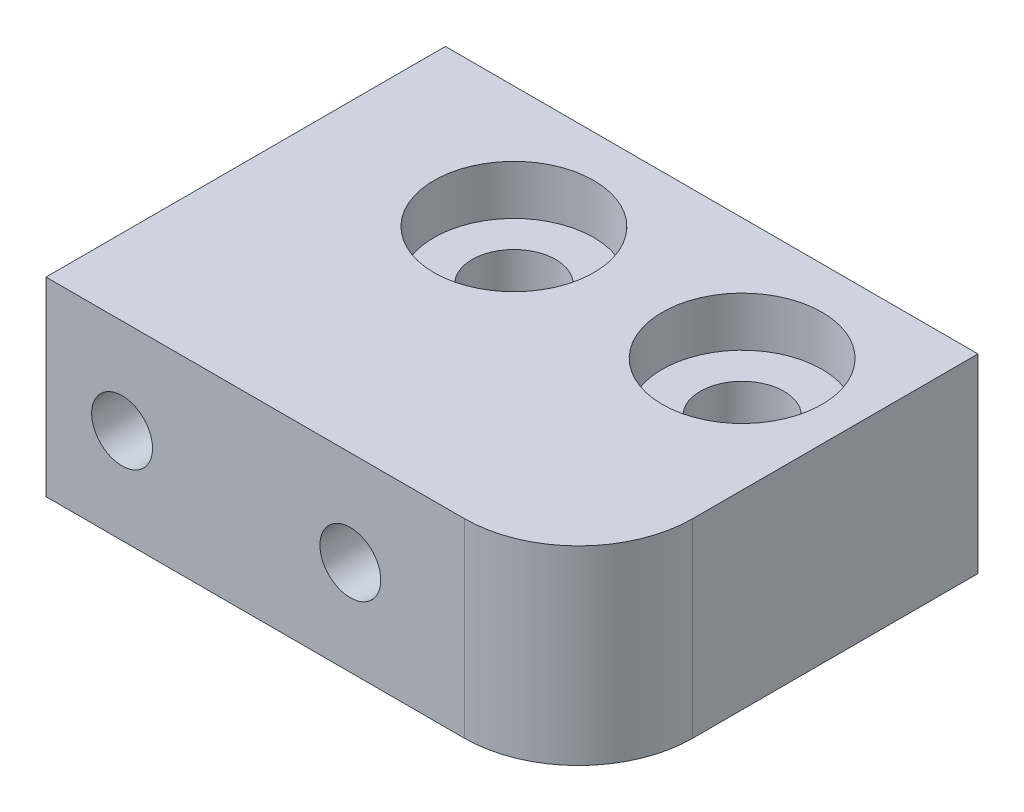
ISO-10303-21;
HEADER;
FILE_DESCRIPTION(('STEP AP214'),'2;1');
FILE_NAME('part.step','',(''),(''),'','','');
FILE_SCHEMA(('AUTOMOTIVE_DESIGN { 1 0 10303 214 1 1 1 1 }'));
ENDSEC;
DATA;
#1=APPLICATION_CONTEXT('core data for automotive mechanical design processes');
#2=APPLICATION_PROTOCOL_DEFINITION('international standard','automotive_design',2000,#1);
#3=PRODUCT_CONTEXT('',#1,'mechanical');
#4=PRODUCT('Part','Part','',(#3));
#5=PRODUCT_RELATED_PRODUCT_CATEGORY('part','',(#4));
#6=PRODUCT_DEFINITION_FORMATION('','',#4);
#7=PRODUCT_DEFINITION_CONTEXT('part definition',#1,'design');
#8=PRODUCT_DEFINITION('design','',#6,#7);
#9=PRODUCT_DEFINITION_SHAPE('','',#8);
#10=(LENGTH_UNIT() NAMED_UNIT(*) SI_UNIT(.MILLI.,.METRE.));
#11=(NAMED_UNIT(*) PLANE_ANGLE_UNIT() SI_UNIT($,.RADIAN.));
#12=(NAMED_UNIT(*) SI_UNIT($,.STERADIAN.) SOLID_ANGLE_UNIT());
#13=UNCERTAINTY_MEASURE_WITH_UNIT(LENGTH_MEASURE(1.E-05),#10,'distance_accuracy_value','');
#14=(GEOMETRIC_REPRESENTATION_CONTEXT(3) GLOBAL_UNCERTAINTY_ASSIGNED_CONTEXT((#13)) GLOBAL_UNIT_ASSIGNED_CONTEXT((#10,
#11,#12)) REPRESENTATION_CONTEXT('',''));
#15=CARTESIAN_POINT('',(0.,0.,0.));
#16=DIRECTION('',(0.,0.,1.));
#17=DIRECTION('',(1.,0.,0.));
#18=AXIS2_PLACEMENT_3D('',#15,#16,#17);
#19=CARTESIAN_POINT('',(7.,5.,-5.25));
#20=DIRECTION('',(-1.,0.,0.));
#21=DIRECTION('',(0.,0.,1.));
#22=AXIS2_PLACEMENT_3D('',#19,#20,#21);
#23=PLANE('',#22);
#24=DIRECTION('',(0.,0.,-1.));
#25=VECTOR('',#24,1.);
#26=CARTESIAN_POINT('',(7.,5.,-5.25));
#27=LINE('',#26,#25);
#28=CARTESIAN_POINT('',(7.,5.,2.25));
#29=VERTEX_POINT('',#28);
#30=CARTESIAN_POINT('',(7.,5.,-5.25));
#31=VERTEX_POINT('',#30);
#32=EDGE_CURVE('E82',#29,#31,#27,.T.);
#33=ORIENTED_EDGE('',*,*,#32,.F.);
#34=DIRECTION('',(0.,-1.,0.));
#35=VECTOR('',#34,1.);
#36=CARTESIAN_POINT('',(7.,5.,2.25));
#37=LINE('',#36,#35);
#38=CARTESIAN_POINT('',(7.,0.,2.25));
#39=VERTEX_POINT('',#38);
#40=EDGE_CURVE('E105',#29,#39,#37,.T.);
#41=ORIENTED_EDGE('',*,*,#40,.T.);
#42=DIRECTION('',(0.,0.,-1.));
#43=VECTOR('',#42,1.);
#44=CARTESIAN_POINT('',(7.,0.,-5.25));
#45=LINE('',#44,#43);
#46=CARTESIAN_POINT('',(7.,0.,-5.25));
#47=VERTEX_POINT('',#46);
#48=EDGE_CURVE('E103',#39,#47,#45,.T.);
#49=ORIENTED_EDGE('',*,*,#48,.T.);
#50=DIRECTION('',(0.,-1.,0.));
#51=VECTOR('',#50,1.);
#52=CARTESIAN_POINT('',(7.,5.,-5.25));
#53=LINE('',#52,#51);
#54=EDGE_CURVE('E97',#31,#47,#53,.T.);
#55=ORIENTED_EDGE('',*,*,#54,.F.);
#56=EDGE_LOOP('',(#33,#41,#49,#55));
#57=FACE_BOUND('',#56,.T.);
#58=ADVANCED_FACE('F36',(#57),#23,.F.);
#59=CARTESIAN_POINT('',(-7.,5.,-5.25));
#60=DIRECTION('',(0.,0.,1.));
#61=DIRECTION('',(1.,0.,0.));
#62=AXIS2_PLACEMENT_3D('',#59,#60,#61);
#63=PLANE('',#62);
#64=CARTESIAN_POINT('',(-5.,2.5,-5.25));
#65=DIRECTION('',(0.,0.,1.));
#66=DIRECTION('',(1.,0.,0.));
#67=AXIS2_PLACEMENT_3D('',#64,#65,#66);
#68=CIRCLE('',#67,0.799999999999997);
#69=CARTESIAN_POINT('',(-4.2,2.5,-5.25));
#70=VERTEX_POINT('',#69);
#71=EDGE_CURVE('E153',#70,#70,#68,.T.);
#72=ORIENTED_EDGE('',*,*,#71,.T.);
#73=EDGE_LOOP('',(#72));
#74=FACE_BOUND('',#73,.T.);
#75=CARTESIAN_POINT('',(1.,2.5,-5.25));
#76=DIRECTION('',(0.,0.,1.));
#77=DIRECTION('',(1.,0.,0.));
#78=AXIS2_PLACEMENT_3D('',#75,#76,#77);
#79=CIRCLE('',#78,0.799999999999997);
#80=CARTESIAN_POINT('',(1.8,2.5,-5.25));
#81=VERTEX_POINT('',#80);
#82=EDGE_CURVE('E147',#81,#81,#79,.T.);
#83=ORIENTED_EDGE('',*,*,#82,.T.);
#84=EDGE_LOOP('',(#83));
#85=FACE_BOUND('',#84,.T.);
#86=DIRECTION('',(-1.,0.,0.));
#87=VECTOR('',#86,1.);
#88=CARTESIAN_POINT('',(-7.,0.,-5.25));
#89=LINE('',#88,#87);
#90=CARTESIAN_POINT('',(-7.,0.,-5.25));
#91=VERTEX_POINT('',#90);
#92=EDGE_CURVE('E118',#47,#91,#89,.T.);
#93=ORIENTED_EDGE('',*,*,#92,.T.);
#94=DIRECTION('',(0.,-1.,0.));
#95=VECTOR('',#94,1.);
#96=CARTESIAN_POINT('',(-7.,5.,-5.25));
#97=LINE('',#96,#95);
#98=CARTESIAN_POINT('',(-7.,5.,-5.25));
#99=VERTEX_POINT('',#98);
#100=EDGE_CURVE('E99',#99,#91,#97,.T.);
#101=ORIENTED_EDGE('',*,*,#100,.F.);
#102=DIRECTION('',(-1.,0.,0.));
#103=VECTOR('',#102,1.);
#104=CARTESIAN_POINT('',(-7.,5.,-5.25));
#105=LINE('',#104,#103);
#106=EDGE_CURVE('E85',#31,#99,#105,.T.);
#107=ORIENTED_EDGE('',*,*,#106,.F.);
#108=ORIENTED_EDGE('',*,*,#54,.T.);
#109=EDGE_LOOP('',(#93,#101,#107,#108));
#110=FACE_BOUND('',#109,.T.);
#111=ADVANCED_FACE('F96',(#74,#85,#110),#63,.F.);
#112=CARTESIAN_POINT('',(-7.,5.,-5.25));
#113=DIRECTION('',(1.,0.,0.));
#114=DIRECTION('',(0.,0.,-1.));
#115=AXIS2_PLACEMENT_3D('',#112,#113,#114);
#116=PLANE('',#115);
#117=DIRECTION('',(0.,0.,1.));
#118=VECTOR('',#117,1.);
#119=CARTESIAN_POINT('',(-7.,0.,-5.25));
#120=LINE('',#119,#118);
#121=CARTESIAN_POINT('',(-7.,0.,5.25));
#122=VERTEX_POINT('',#121);
#123=EDGE_CURVE('E116',#91,#122,#120,.T.);
#124=ORIENTED_EDGE('',*,*,#123,.T.);
#125=DIRECTION('',(0.,-1.,0.));
#126=VECTOR('',#125,1.);
#127=CARTESIAN_POINT('',(-7.,5.,5.25));
#128=LINE('',#127,#126);
#129=CARTESIAN_POINT('',(-7.,5.,5.25));
#130=VERTEX_POINT('',#129);
#131=EDGE_CURVE('E108',#130,#122,#128,.T.);
#132=ORIENTED_EDGE('',*,*,#131,.F.);
#133=DIRECTION('',(0.,0.,1.));
#134=VECTOR('',#133,1.);
#135=CARTESIAN_POINT('',(-7.,5.,-5.25));
#136=LINE('',#135,#134);
#137=EDGE_CURVE('E101',#99,#130,#136,.T.);
#138=ORIENTED_EDGE('',*,*,#137,.F.);
#139=ORIENTED_EDGE('',*,*,#100,.T.);
#140=EDGE_LOOP('',(#124,#132,#138,#139));
#141=FACE_BOUND('',#140,.T.);
#142=ADVANCED_FACE('F165',(#141),#116,.F.);
#143=CARTESIAN_POINT('',(-7.,5.,5.25));
#144=DIRECTION('',(0.,0.,-1.));
#145=DIRECTION('',(-1.,0.,0.));
#146=AXIS2_PLACEMENT_3D('',#143,#144,#145);
#147=PLANE('',#146);
#148=CARTESIAN_POINT('',(-5.,2.5,5.25));
#149=DIRECTION('',(0.,0.,1.));
#150=DIRECTION('',(1.,0.,0.));
#151=AXIS2_PLACEMENT_3D('',#148,#149,#150);
#152=CIRCLE('',#151,0.799999999999988);
#153=CARTESIAN_POINT('',(-4.20000000000001,2.5,5.25));
#154=VERTEX_POINT('',#153);
#155=EDGE_CURVE('E156',#154,#154,#152,.T.);
#156=ORIENTED_EDGE('',*,*,#155,.F.);
#157=EDGE_LOOP('',(#156));
#158=FACE_BOUND('',#157,.T.);
#159=CARTESIAN_POINT('',(1.,2.5,5.25));
#160=DIRECTION('',(0.,0.,1.));
#161=DIRECTION('',(1.,0.,0.));
#162=AXIS2_PLACEMENT_3D('',#159,#160,#161);
#163=CIRCLE('',#162,0.799999999999988);
#164=CARTESIAN_POINT('',(1.79999999999999,2.5,5.25));
#165=VERTEX_POINT('',#164);
#166=EDGE_CURVE('E150',#165,#165,#163,.T.);
#167=ORIENTED_EDGE('',*,*,#166,.F.);
#168=EDGE_LOOP('',(#167));
#169=FACE_BOUND('',#168,.T.);
#170=DIRECTION('',(1.,0.,0.));
#171=VECTOR('',#170,1.);
#172=CARTESIAN_POINT('',(-7.,0.,5.25));
#173=LINE('',#172,#171);
#174=CARTESIAN_POINT('',(4.,0.,5.25));
#175=VERTEX_POINT('',#174);
#176=EDGE_CURVE('E92',#122,#175,#173,.T.);
#177=ORIENTED_EDGE('',*,*,#176,.T.);
#178=DIRECTION('',(0.,-1.,0.));
#179=VECTOR('',#178,1.);
#180=CARTESIAN_POINT('',(4.,5.,5.25));
#181=LINE('',#180,#179);
#182=CARTESIAN_POINT('',(4.,5.,5.25));
#183=VERTEX_POINT('',#182);
#184=EDGE_CURVE('E44',#175,#183,#181,.F.);
#185=ORIENTED_EDGE('',*,*,#184,.T.);
#186=DIRECTION('',(1.,0.,0.));
#187=VECTOR('',#186,1.);
#188=CARTESIAN_POINT('',(-7.,5.,5.25));
#189=LINE('',#188,#187);
#190=EDGE_CURVE('E114',#130,#183,#189,.T.);
#191=ORIENTED_EDGE('',*,*,#190,.F.);
#192=ORIENTED_EDGE('',*,*,#131,.T.);
#193=EDGE_LOOP('',(#177,#185,#191,#192));
#194=FACE_BOUND('',#193,.T.);
#195=ADVANCED_FACE('F162',(#158,#169,#194),#147,.F.);
#196=CARTESIAN_POINT('',(0.,5.,0.));
#197=DIRECTION('',(0.,1.,0.));
#198=DIRECTION('',(0.,0.,1.));
#199=AXIS2_PLACEMENT_3D('',#196,#197,#198);
#200=PLANE('',#199);
#201=CARTESIAN_POINT('',(-2.,5.,-2.05));
#202=DIRECTION('',(0.,1.,0.));
#203=DIRECTION('',(0.,0.,1.));
#204=AXIS2_PLACEMENT_3D('',#201,#202,#203);
#205=CIRCLE('',#204,2.10000000000002);
#206=CARTESIAN_POINT('',(-2.,5.,0.0500000000000157));
#207=VERTEX_POINT('',#206);
#208=EDGE_CURVE('E144',#207,#207,#205,.T.);
#209=ORIENTED_EDGE('',*,*,#208,.F.);
#210=EDGE_LOOP('',(#209));
#211=FACE_BOUND('',#210,.T.);
#212=CARTESIAN_POINT('',(4.,5.,-2.05));
#213=DIRECTION('',(0.,1.,0.));
#214=DIRECTION('',(0.,0.,1.));
#215=AXIS2_PLACEMENT_3D('',#212,#213,#214);
#216=CIRCLE('',#215,2.10000000000002);
#217=CARTESIAN_POINT('',(4.,5.,0.0500000000000157));
#218=VERTEX_POINT('',#217);
#219=EDGE_CURVE('E132',#218,#218,#216,.T.);
#220=ORIENTED_EDGE('',*,*,#219,.F.);
#221=EDGE_LOOP('',(#220));
#222=FACE_BOUND('',#221,.T.);
#223=ORIENTED_EDGE('',*,*,#190,.T.);
#224=CARTESIAN_POINT('',(4.,5.,2.25));
#225=DIRECTION('',(0.,1.,0.));
#226=DIRECTION('',(0.,0.,1.));
#227=AXIS2_PLACEMENT_3D('',#224,#225,#226);
#228=CIRCLE('',#227,3.);
#229=EDGE_CURVE('E11',#183,#29,#228,.T.);
#230=ORIENTED_EDGE('',*,*,#229,.T.);
#231=ORIENTED_EDGE('',*,*,#32,.T.);
#232=ORIENTED_EDGE('',*,*,#106,.T.);
#233=ORIENTED_EDGE('',*,*,#137,.T.);
#234=EDGE_LOOP('',(#223,#230,#231,#232,#233));
#235=FACE_BOUND('',#234,.T.);
#236=ADVANCED_FACE('F84',(#211,#222,#235),#200,.T.);
#237=CARTESIAN_POINT('',(0.,0.,0.));
#238=DIRECTION('',(0.,1.,0.));
#239=DIRECTION('',(0.,0.,1.));
#240=AXIS2_PLACEMENT_3D('',#237,#238,#239);
#241=PLANE('',#240);
#242=CARTESIAN_POINT('',(-2.,0.,-2.05));
#243=DIRECTION('',(0.,1.,0.));
#244=DIRECTION('',(0.,0.,1.));
#245=AXIS2_PLACEMENT_3D('',#242,#243,#244);
#246=CIRCLE('',#245,1.10000000000001);
#247=CARTESIAN_POINT('',(-2.,0.,-0.949999999999986));
#248=VERTEX_POINT('',#247);
#249=EDGE_CURVE('E135',#248,#248,#246,.T.);
#250=ORIENTED_EDGE('',*,*,#249,.T.);
#251=EDGE_LOOP('',(#250));
#252=FACE_BOUND('',#251,.T.);
#253=CARTESIAN_POINT('',(4.,0.,-2.05));
#254=DIRECTION('',(0.,1.,0.));
#255=DIRECTION('',(0.,0.,1.));
#256=AXIS2_PLACEMENT_3D('',#253,#254,#255);
#257=CIRCLE('',#256,1.10000000000001);
#258=CARTESIAN_POINT('',(4.,0.,-0.949999999999987));
#259=VERTEX_POINT('',#258);
#260=EDGE_CURVE('E121',#259,#259,#257,.T.);
#261=ORIENTED_EDGE('',*,*,#260,.T.);
#262=EDGE_LOOP('',(#261));
#263=FACE_BOUND('',#262,.T.);
#264=ORIENTED_EDGE('',*,*,#48,.F.);
#265=CARTESIAN_POINT('',(4.,0.,2.25));
#266=DIRECTION('',(0.,1.,0.));
#267=DIRECTION('',(0.,0.,1.));
#268=AXIS2_PLACEMENT_3D('',#265,#266,#267);
#269=CIRCLE('',#268,3.);
#270=EDGE_CURVE('E58',#39,#175,#269,.F.);
#271=ORIENTED_EDGE('',*,*,#270,.T.);
#272=ORIENTED_EDGE('',*,*,#176,.F.);
#273=ORIENTED_EDGE('',*,*,#123,.F.);
#274=ORIENTED_EDGE('',*,*,#92,.F.);
#275=EDGE_LOOP('',(#264,#271,#272,#273,#274));
#276=FACE_BOUND('',#275,.T.);
#277=ADVANCED_FACE('F171',(#252,#263,#276),#241,.F.);
#278=CARTESIAN_POINT('',(4.,5.,-2.05));
#279=DIRECTION('',(0.,1.,0.));
#280=DIRECTION('',(0.,0.,1.));
#281=AXIS2_PLACEMENT_3D('',#278,#279,#280);
#282=CYLINDRICAL_SURFACE('',#281,1.10000000000001);
#283=ORIENTED_EDGE('',*,*,#260,.F.);
#284=EDGE_LOOP('',(#283));
#285=FACE_BOUND('',#284,.T.);
#286=CARTESIAN_POINT('',(4.,3.7,-2.05));
#287=DIRECTION('',(0.,1.,0.));
#288=DIRECTION('',(0.,0.,1.));
#289=AXIS2_PLACEMENT_3D('',#286,#287,#288);
#290=CIRCLE('',#289,1.10000000000001);
#291=CARTESIAN_POINT('',(4.,3.7,-0.949999999999986));
#292=VERTEX_POINT('',#291);
#293=EDGE_CURVE('E126',#292,#292,#290,.T.);
#294=ORIENTED_EDGE('',*,*,#293,.T.);
#295=EDGE_LOOP('',(#294));
#296=FACE_BOUND('',#295,.T.);
#297=ADVANCED_FACE('F227',(#285,#296),#282,.F.);
#298=CARTESIAN_POINT('',(5.10000000000001,3.7,-2.05));
#299=DIRECTION('',(0.,-1.,0.));
#300=DIRECTION('',(0.,0.,-1.));
#301=AXIS2_PLACEMENT_3D('',#298,#299,#300);
#302=PLANE('',#301);
#303=ORIENTED_EDGE('',*,*,#293,.F.);
#304=EDGE_LOOP('',(#303));
#305=FACE_BOUND('',#304,.T.);
#306=CARTESIAN_POINT('',(4.,3.7,-2.05));
#307=DIRECTION('',(0.,1.,0.));
#308=DIRECTION('',(0.,0.,1.));
#309=AXIS2_PLACEMENT_3D('',#306,#307,#308);
#310=CIRCLE('',#309,2.10000000000001);
#311=CARTESIAN_POINT('',(4.,3.7,0.050000000000014));
#312=VERTEX_POINT('',#311);
#313=EDGE_CURVE('E129',#312,#312,#310,.T.);
#314=ORIENTED_EDGE('',*,*,#313,.T.);
#315=EDGE_LOOP('',(#314));
#316=FACE_BOUND('',#315,.T.);
#317=ADVANCED_FACE('F259',(#305,#316),#302,.F.);
#318=CARTESIAN_POINT('',(4.,5.,-2.05));
#319=DIRECTION('',(0.,1.,0.));
#320=DIRECTION('',(0.,0.,1.));
#321=AXIS2_PLACEMENT_3D('',#318,#319,#320);
#322=CYLINDRICAL_SURFACE('',#321,2.10000000000001);
#323=ORIENTED_EDGE('',*,*,#313,.F.);
#324=EDGE_LOOP('',(#323));
#325=FACE_BOUND('',#324,.T.);
#326=ORIENTED_EDGE('',*,*,#219,.T.);
#327=EDGE_LOOP('',(#326));
#328=FACE_BOUND('',#327,.T.);
#329=ADVANCED_FACE('F266',(#325,#328),#322,.F.);
#330=CARTESIAN_POINT('',(-2.,5.,-2.05));
#331=DIRECTION('',(0.,1.,0.));
#332=DIRECTION('',(0.,0.,1.));
#333=AXIS2_PLACEMENT_3D('',#330,#331,#332);
#334=CYLINDRICAL_SURFACE('',#333,1.10000000000001);
#335=ORIENTED_EDGE('',*,*,#249,.F.);
#336=EDGE_LOOP('',(#335));
#337=FACE_BOUND('',#336,.T.);
#338=CARTESIAN_POINT('',(-2.,3.7,-2.05));
#339=DIRECTION('',(0.,1.,0.));
#340=DIRECTION('',(0.,0.,1.));
#341=AXIS2_PLACEMENT_3D('',#338,#339,#340);
#342=CIRCLE('',#341,1.10000000000001);
#343=CARTESIAN_POINT('',(-2.,3.7,-0.949999999999986));
#344=VERTEX_POINT('',#343);
#345=EDGE_CURVE('E138',#344,#344,#342,.T.);
#346=ORIENTED_EDGE('',*,*,#345,.T.);
#347=EDGE_LOOP('',(#346));
#348=FACE_BOUND('',#347,.T.);
#349=ADVANCED_FACE('F274',(#337,#348),#334,.F.);
#350=CARTESIAN_POINT('',(-0.899999999999985,3.7,-2.05));
#351=DIRECTION('',(0.,-1.,0.));
#352=DIRECTION('',(0.,0.,-1.));
#353=AXIS2_PLACEMENT_3D('',#350,#351,#352);
#354=PLANE('',#353);
#355=ORIENTED_EDGE('',*,*,#345,.F.);
#356=EDGE_LOOP('',(#355));
#357=FACE_BOUND('',#356,.T.);
#358=CARTESIAN_POINT('',(-2.,3.7,-2.05));
#359=DIRECTION('',(0.,1.,0.));
#360=DIRECTION('',(0.,0.,1.));
#361=AXIS2_PLACEMENT_3D('',#358,#359,#360);
#362=CIRCLE('',#361,2.10000000000001);
#363=CARTESIAN_POINT('',(-2.,3.7,0.050000000000014));
#364=VERTEX_POINT('',#363);
#365=EDGE_CURVE('E141',#364,#364,#362,.T.);
#366=ORIENTED_EDGE('',*,*,#365,.T.);
#367=EDGE_LOOP('',(#366));
#368=FACE_BOUND('',#367,.T.);
#369=ADVANCED_FACE('F282',(#357,#368),#354,.F.);
#370=CARTESIAN_POINT('',(-2.,5.,-2.05));
#371=DIRECTION('',(0.,1.,0.));
#372=DIRECTION('',(0.,0.,1.));
#373=AXIS2_PLACEMENT_3D('',#370,#371,#372);
#374=CYLINDRICAL_SURFACE('',#373,2.10000000000001);
#375=ORIENTED_EDGE('',*,*,#365,.F.);
#376=EDGE_LOOP('',(#375));
#377=FACE_BOUND('',#376,.T.);
#378=ORIENTED_EDGE('',*,*,#208,.T.);
#379=EDGE_LOOP('',(#378));
#380=FACE_BOUND('',#379,.T.);
#381=ADVANCED_FACE('F290',(#377,#380),#374,.F.);
#382=CARTESIAN_POINT('',(4.,5.,2.25));
#383=DIRECTION('',(0.,-1.,0.));
#384=DIRECTION('',(0.,0.,-1.));
#385=AXIS2_PLACEMENT_3D('',#382,#383,#384);
#386=CYLINDRICAL_SURFACE('',#385,3.);
#387=ORIENTED_EDGE('',*,*,#229,.F.);
#388=ORIENTED_EDGE('',*,*,#184,.F.);
#389=ORIENTED_EDGE('',*,*,#270,.F.);
#390=ORIENTED_EDGE('',*,*,#40,.F.);
#391=EDGE_LOOP('',(#387,#388,#389,#390));
#392=FACE_BOUND('',#391,.T.);
#393=ADVANCED_FACE('F38',(#392),#386,.T.);
#394=CARTESIAN_POINT('',(1.,2.5,5.25));
#395=DIRECTION('',(0.,0.,1.));
#396=DIRECTION('',(1.,0.,0.));
#397=AXIS2_PLACEMENT_3D('',#394,#395,#396);
#398=CYLINDRICAL_SURFACE('',#397,0.799999999999993);
#399=ORIENTED_EDGE('',*,*,#82,.F.);
#400=EDGE_LOOP('',(#399));
#401=FACE_BOUND('',#400,.T.);
#402=ORIENTED_EDGE('',*,*,#166,.T.);
#403=EDGE_LOOP('',(#402));
#404=FACE_BOUND('',#403,.T.);
#405=ADVANCED_FACE('F203',(#401,#404),#398,.F.);
#406=CARTESIAN_POINT('',(-5.,2.5,5.25));
#407=DIRECTION('',(0.,0.,1.));
#408=DIRECTION('',(1.,0.,0.));
#409=AXIS2_PLACEMENT_3D('',#406,#407,#408);
#410=CYLINDRICAL_SURFACE('',#409,0.799999999999993);
#411=ORIENTED_EDGE('',*,*,#71,.F.);
#412=EDGE_LOOP('',(#411));
#413=FACE_BOUND('',#412,.T.);
#414=ORIENTED_EDGE('',*,*,#155,.T.);
#415=EDGE_LOOP('',(#414));
#416=FACE_BOUND('',#415,.T.);
#417=ADVANCED_FACE('F160',(#413,#416),#410,.F.);
#418=CLOSED_SHELL('',(#58,#111,#142,#195,#236,#277,#297,#317,#329,#349,#369,#381,#393,#405,#417));
#419=MANIFOLD_SOLID_BREP('B2',#418);
#420=ADVANCED_BREP_SHAPE_REPRESENTATION('',(#18,#419),#14);
#421=SHAPE_DEFINITION_REPRESENTATION(#9,#420);
ENDSEC;
END-ISO-10303-21;
